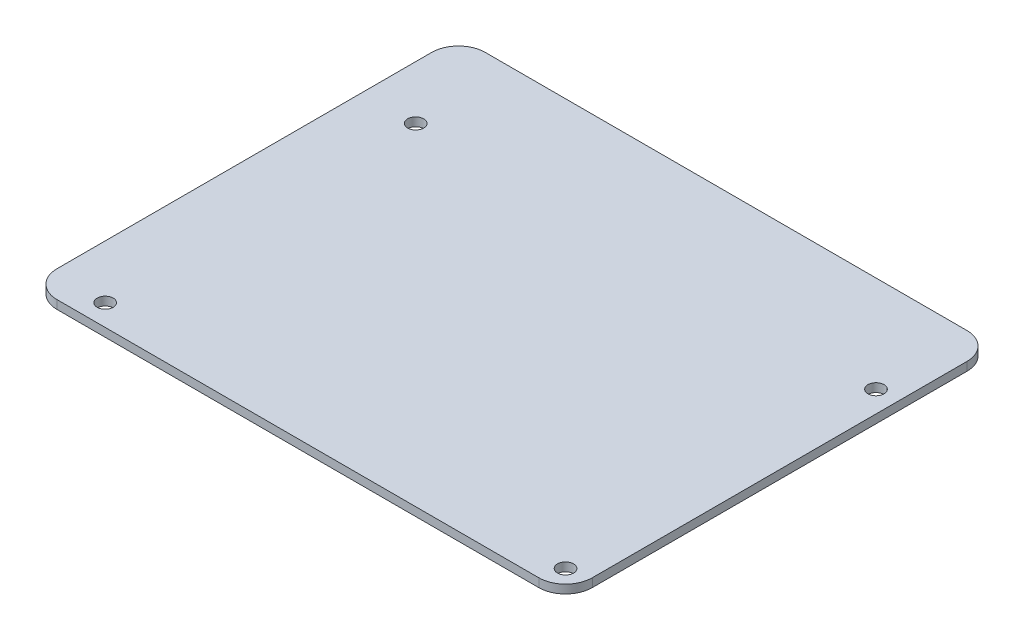
ISO-10303-21;
HEADER;
FILE_DESCRIPTION(('STEP AP214'),'2;1');
FILE_NAME('part.step','',(''),(''),'','','');
FILE_SCHEMA(('AUTOMOTIVE_DESIGN { 1 0 10303 214 1 1 1 1 }'));
ENDSEC;
DATA;
#1=APPLICATION_CONTEXT('core data for automotive mechanical design processes');
#2=APPLICATION_PROTOCOL_DEFINITION('international standard','automotive_design',2000,#1);
#3=PRODUCT_CONTEXT('',#1,'mechanical');
#4=PRODUCT('Part','Part','',(#3));
#5=PRODUCT_RELATED_PRODUCT_CATEGORY('part','',(#4));
#6=PRODUCT_DEFINITION_FORMATION('','',#4);
#7=PRODUCT_DEFINITION_CONTEXT('part definition',#1,'design');
#8=PRODUCT_DEFINITION('design','',#6,#7);
#9=PRODUCT_DEFINITION_SHAPE('','',#8);
#10=(LENGTH_UNIT() NAMED_UNIT(*) SI_UNIT(.MILLI.,.METRE.));
#11=(NAMED_UNIT(*) PLANE_ANGLE_UNIT() SI_UNIT($,.RADIAN.));
#12=(NAMED_UNIT(*) SI_UNIT($,.STERADIAN.) SOLID_ANGLE_UNIT());
#13=UNCERTAINTY_MEASURE_WITH_UNIT(LENGTH_MEASURE(1.E-05),#10,'distance_accuracy_value','');
#14=(GEOMETRIC_REPRESENTATION_CONTEXT(3) GLOBAL_UNCERTAINTY_ASSIGNED_CONTEXT((#13)) GLOBAL_UNIT_ASSIGNED_CONTEXT((#10,
#11,#12)) REPRESENTATION_CONTEXT('',''));
#15=CARTESIAN_POINT('',(0.,0.,0.));
#16=DIRECTION('',(0.,0.,1.));
#17=DIRECTION('',(1.,0.,0.));
#18=AXIS2_PLACEMENT_3D('',#15,#16,#17);
#19=CARTESIAN_POINT('',(50.,0.,40.));
#20=DIRECTION('',(0.,1.,0.));
#21=DIRECTION('',(1.,0.,0.));
#22=AXIS2_PLACEMENT_3D('',#19,#20,#21);
#23=PLANE('',#22);
#24=CARTESIAN_POINT('',(10.0000001490116,0.,76.0000011324883));
#25=DIRECTION('',(0.,1.,0.));
#26=DIRECTION('',(1.,0.,0.));
#27=AXIS2_PLACEMENT_3D('',#24,#25,#26);
#28=CIRCLE('',#27,1.5);
#29=CARTESIAN_POINT('',(8.50000014901161,0.,76.0000011324883));
#30=VERTEX_POINT('',#29);
#31=EDGE_CURVE('E218',#30,#30,#28,.T.);
#32=ORIENTED_EDGE('',*,*,#31,.T.);
#33=EDGE_LOOP('',(#32));
#34=FACE_BOUND('',#33,.T.);
#35=CARTESIAN_POINT('',(96.0000014305115,0.,76.0000011324883));
#36=DIRECTION('',(0.,1.,0.));
#37=DIRECTION('',(1.,0.,0.));
#38=AXIS2_PLACEMENT_3D('',#35,#36,#37);
#39=CIRCLE('',#38,1.5);
#40=CARTESIAN_POINT('',(94.5000014305115,0.,76.0000011324883));
#41=VERTEX_POINT('',#40);
#42=EDGE_CURVE('E210',#41,#41,#39,.T.);
#43=ORIENTED_EDGE('',*,*,#42,.T.);
#44=EDGE_LOOP('',(#43));
#45=FACE_BOUND('',#44,.T.);
#46=CARTESIAN_POINT('',(96.0000014305115,0.,18.0000002682209));
#47=DIRECTION('',(0.,1.,0.));
#48=DIRECTION('',(1.,0.,0.));
#49=AXIS2_PLACEMENT_3D('',#46,#47,#48);
#50=CIRCLE('',#49,1.5);
#51=CARTESIAN_POINT('',(94.5000014305115,0.,18.0000002682209));
#52=VERTEX_POINT('',#51);
#53=EDGE_CURVE('E257',#52,#52,#50,.T.);
#54=ORIENTED_EDGE('',*,*,#53,.T.);
#55=EDGE_LOOP('',(#54));
#56=FACE_BOUND('',#55,.T.);
#57=CARTESIAN_POINT('',(10.0000001490116,0.,18.0000002682209));
#58=DIRECTION('',(0.,1.,0.));
#59=DIRECTION('',(1.,0.,0.));
#60=AXIS2_PLACEMENT_3D('',#57,#58,#59);
#61=CIRCLE('',#60,1.5);
#62=CARTESIAN_POINT('',(8.50000014901161,0.,18.0000002682209));
#63=VERTEX_POINT('',#62);
#64=EDGE_CURVE('E206',#63,#63,#61,.T.);
#65=ORIENTED_EDGE('',*,*,#64,.T.);
#66=EDGE_LOOP('',(#65));
#67=FACE_BOUND('',#66,.T.);
#68=CARTESIAN_POINT('',(95.,0.,5.));
#69=DIRECTION('',(0.,1.,0.));
#70=DIRECTION('',(1.,0.,0.));
#71=AXIS2_PLACEMENT_3D('',#68,#69,#70);
#72=CIRCLE('',#71,5.);
#73=CARTESIAN_POINT('',(100.,0.,5.));
#74=VERTEX_POINT('',#73);
#75=CARTESIAN_POINT('',(95.,0.,0.));
#76=VERTEX_POINT('',#75);
#77=EDGE_CURVE('E26',#74,#76,#72,.T.);
#78=ORIENTED_EDGE('',*,*,#77,.F.);
#79=DIRECTION('',(0.,0.,1.));
#80=VECTOR('',#79,1.);
#81=CARTESIAN_POINT('',(100.,0.,5.));
#82=LINE('',#81,#80);
#83=CARTESIAN_POINT('',(100.,0.,75.));
#84=VERTEX_POINT('',#83);
#85=EDGE_CURVE('E203',#74,#84,#82,.T.);
#86=ORIENTED_EDGE('',*,*,#85,.T.);
#87=CARTESIAN_POINT('',(95.,0.,75.));
#88=DIRECTION('',(0.,1.,0.));
#89=DIRECTION('',(0.,0.,1.));
#90=AXIS2_PLACEMENT_3D('',#87,#88,#89);
#91=CIRCLE('',#90,5.);
#92=CARTESIAN_POINT('',(95.,0.,80.));
#93=VERTEX_POINT('',#92);
#94=EDGE_CURVE('E170',#93,#84,#91,.T.);
#95=ORIENTED_EDGE('',*,*,#94,.F.);
#96=DIRECTION('',(-1.,0.,0.));
#97=VECTOR('',#96,1.);
#98=CARTESIAN_POINT('',(95.,0.,80.));
#99=LINE('',#98,#97);
#100=CARTESIAN_POINT('',(5.,0.,80.));
#101=VERTEX_POINT('',#100);
#102=EDGE_CURVE('E155',#93,#101,#99,.T.);
#103=ORIENTED_EDGE('',*,*,#102,.T.);
#104=CARTESIAN_POINT('',(5.,0.,75.));
#105=DIRECTION('',(0.,1.,0.));
#106=DIRECTION('',(-1.,0.,0.));
#107=AXIS2_PLACEMENT_3D('',#104,#105,#106);
#108=CIRCLE('',#107,5.);
#109=CARTESIAN_POINT('',(0.,0.,75.));
#110=VERTEX_POINT('',#109);
#111=EDGE_CURVE('E19',#110,#101,#108,.T.);
#112=ORIENTED_EDGE('',*,*,#111,.F.);
#113=DIRECTION('',(0.,0.,-1.));
#114=VECTOR('',#113,1.);
#115=CARTESIAN_POINT('',(0.,0.,75.));
#116=LINE('',#115,#114);
#117=CARTESIAN_POINT('',(0.,0.,5.));
#118=VERTEX_POINT('',#117);
#119=EDGE_CURVE('E119',#110,#118,#116,.T.);
#120=ORIENTED_EDGE('',*,*,#119,.T.);
#121=CARTESIAN_POINT('',(5.,0.,5.));
#122=DIRECTION('',(0.,1.,0.));
#123=DIRECTION('',(0.,0.,-1.));
#124=AXIS2_PLACEMENT_3D('',#121,#122,#123);
#125=CIRCLE('',#124,5.);
#126=CARTESIAN_POINT('',(5.,0.,0.));
#127=VERTEX_POINT('',#126);
#128=EDGE_CURVE('E136',#127,#118,#125,.T.);
#129=ORIENTED_EDGE('',*,*,#128,.F.);
#130=DIRECTION('',(1.,0.,0.));
#131=VECTOR('',#130,1.);
#132=CARTESIAN_POINT('',(5.,0.,0.));
#133=LINE('',#132,#131);
#134=EDGE_CURVE('E190',#127,#76,#133,.T.);
#135=ORIENTED_EDGE('',*,*,#134,.T.);
#136=EDGE_LOOP('',(#78,#86,#95,#103,#112,#120,#129,#135));
#137=FACE_BOUND('',#136,.T.);
#138=ADVANCED_FACE('F15',(#34,#45,#56,#67,#137),#23,.F.);
#139=CARTESIAN_POINT('',(50.,1.6,40.));
#140=DIRECTION('',(0.,1.,0.));
#141=DIRECTION('',(1.,0.,0.));
#142=AXIS2_PLACEMENT_3D('',#139,#140,#141);
#143=PLANE('',#142);
#144=CARTESIAN_POINT('',(10.0000001490116,1.6,76.0000011324883));
#145=DIRECTION('',(0.,-1.,0.));
#146=DIRECTION('',(1.,0.,0.));
#147=AXIS2_PLACEMENT_3D('',#144,#145,#146);
#148=CIRCLE('',#147,1.5);
#149=CARTESIAN_POINT('',(8.50000014901161,1.6,76.0000011324883));
#150=VERTEX_POINT('',#149);
#151=EDGE_CURVE('E219',#150,#150,#148,.T.);
#152=ORIENTED_EDGE('',*,*,#151,.T.);
#153=EDGE_LOOP('',(#152));
#154=FACE_BOUND('',#153,.T.);
#155=CARTESIAN_POINT('',(96.0000014305115,1.6,76.0000011324883));
#156=DIRECTION('',(0.,-1.,0.));
#157=DIRECTION('',(1.,0.,0.));
#158=AXIS2_PLACEMENT_3D('',#155,#156,#157);
#159=CIRCLE('',#158,1.5);
#160=CARTESIAN_POINT('',(94.5000014305115,1.6,76.0000011324883));
#161=VERTEX_POINT('',#160);
#162=EDGE_CURVE('E222',#161,#161,#159,.T.);
#163=ORIENTED_EDGE('',*,*,#162,.T.);
#164=EDGE_LOOP('',(#163));
#165=FACE_BOUND('',#164,.T.);
#166=CARTESIAN_POINT('',(96.0000014305115,1.6,18.0000002682209));
#167=DIRECTION('',(0.,-1.,0.));
#168=DIRECTION('',(1.,0.,0.));
#169=AXIS2_PLACEMENT_3D('',#166,#167,#168);
#170=CIRCLE('',#169,1.5);
#171=CARTESIAN_POINT('',(94.5000014305115,1.6,18.0000002682209));
#172=VERTEX_POINT('',#171);
#173=EDGE_CURVE('E179',#172,#172,#170,.T.);
#174=ORIENTED_EDGE('',*,*,#173,.T.);
#175=EDGE_LOOP('',(#174));
#176=FACE_BOUND('',#175,.T.);
#177=CARTESIAN_POINT('',(10.0000001490116,1.6,18.0000002682209));
#178=DIRECTION('',(0.,-1.,0.));
#179=DIRECTION('',(1.,0.,0.));
#180=AXIS2_PLACEMENT_3D('',#177,#178,#179);
#181=CIRCLE('',#180,1.5);
#182=CARTESIAN_POINT('',(8.50000014901161,1.6,18.0000002682209));
#183=VERTEX_POINT('',#182);
#184=EDGE_CURVE('E236',#183,#183,#181,.T.);
#185=ORIENTED_EDGE('',*,*,#184,.T.);
#186=EDGE_LOOP('',(#185));
#187=FACE_BOUND('',#186,.T.);
#188=CARTESIAN_POINT('',(95.,1.6,5.));
#189=DIRECTION('',(0.,1.,0.));
#190=DIRECTION('',(1.,0.,0.));
#191=AXIS2_PLACEMENT_3D('',#188,#189,#190);
#192=CIRCLE('',#191,5.);
#193=CARTESIAN_POINT('',(100.,1.6,5.));
#194=VERTEX_POINT('',#193);
#195=CARTESIAN_POINT('',(95.,1.6,0.));
#196=VERTEX_POINT('',#195);
#197=EDGE_CURVE('E9',#194,#196,#192,.T.);
#198=ORIENTED_EDGE('',*,*,#197,.T.);
#199=DIRECTION('',(-1.,0.,0.));
#200=VECTOR('',#199,1.);
#201=CARTESIAN_POINT('',(5.,1.6,0.));
#202=LINE('',#201,#200);
#203=CARTESIAN_POINT('',(5.,1.6,0.));
#204=VERTEX_POINT('',#203);
#205=EDGE_CURVE('E230',#196,#204,#202,.T.);
#206=ORIENTED_EDGE('',*,*,#205,.T.);
#207=CARTESIAN_POINT('',(5.,1.6,5.));
#208=DIRECTION('',(0.,1.,0.));
#209=DIRECTION('',(0.,0.,-1.));
#210=AXIS2_PLACEMENT_3D('',#207,#208,#209);
#211=CIRCLE('',#210,5.);
#212=CARTESIAN_POINT('',(0.,1.6,5.));
#213=VERTEX_POINT('',#212);
#214=EDGE_CURVE('E182',#204,#213,#211,.T.);
#215=ORIENTED_EDGE('',*,*,#214,.T.);
#216=DIRECTION('',(0.,0.,1.));
#217=VECTOR('',#216,1.);
#218=CARTESIAN_POINT('',(0.,1.6,75.));
#219=LINE('',#218,#217);
#220=CARTESIAN_POINT('',(0.,1.6,75.));
#221=VERTEX_POINT('',#220);
#222=EDGE_CURVE('E125',#213,#221,#219,.T.);
#223=ORIENTED_EDGE('',*,*,#222,.T.);
#224=CARTESIAN_POINT('',(5.,1.6,75.));
#225=DIRECTION('',(0.,1.,0.));
#226=DIRECTION('',(-1.,0.,0.));
#227=AXIS2_PLACEMENT_3D('',#224,#225,#226);
#228=CIRCLE('',#227,5.);
#229=CARTESIAN_POINT('',(5.,1.6,80.));
#230=VERTEX_POINT('',#229);
#231=EDGE_CURVE('E149',#221,#230,#228,.T.);
#232=ORIENTED_EDGE('',*,*,#231,.T.);
#233=DIRECTION('',(1.,0.,0.));
#234=VECTOR('',#233,1.);
#235=CARTESIAN_POINT('',(95.,1.6,80.));
#236=LINE('',#235,#234);
#237=CARTESIAN_POINT('',(95.,1.6,80.));
#238=VERTEX_POINT('',#237);
#239=EDGE_CURVE('E142',#230,#238,#236,.T.);
#240=ORIENTED_EDGE('',*,*,#239,.T.);
#241=CARTESIAN_POINT('',(95.,1.6,75.));
#242=DIRECTION('',(0.,1.,0.));
#243=DIRECTION('',(0.,0.,1.));
#244=AXIS2_PLACEMENT_3D('',#241,#242,#243);
#245=CIRCLE('',#244,5.);
#246=CARTESIAN_POINT('',(100.,1.6,75.));
#247=VERTEX_POINT('',#246);
#248=EDGE_CURVE('E146',#238,#247,#245,.T.);
#249=ORIENTED_EDGE('',*,*,#248,.T.);
#250=DIRECTION('',(0.,0.,-1.));
#251=VECTOR('',#250,1.);
#252=CARTESIAN_POINT('',(100.,1.6,5.));
#253=LINE('',#252,#251);
#254=EDGE_CURVE('E224',#247,#194,#253,.T.);
#255=ORIENTED_EDGE('',*,*,#254,.T.);
#256=EDGE_LOOP('',(#198,#206,#215,#223,#232,#240,#249,#255));
#257=FACE_BOUND('',#256,.T.);
#258=ADVANCED_FACE('F144',(#154,#165,#176,#187,#257),#143,.T.);
#259=CARTESIAN_POINT('',(95.,0.,5.));
#260=DIRECTION('',(0.,1.,0.));
#261=DIRECTION('',(1.,0.,0.));
#262=AXIS2_PLACEMENT_3D('',#259,#260,#261);
#263=CYLINDRICAL_SURFACE('',#262,5.);
#264=ORIENTED_EDGE('',*,*,#77,.T.);
#265=DIRECTION('',(0.,1.,0.));
#266=VECTOR('',#265,1.);
#267=CARTESIAN_POINT('',(95.,0.,0.));
#268=LINE('',#267,#266);
#269=EDGE_CURVE('E227',#76,#196,#268,.T.);
#270=ORIENTED_EDGE('',*,*,#269,.T.);
#271=ORIENTED_EDGE('',*,*,#197,.F.);
#272=DIRECTION('',(0.,1.,0.));
#273=VECTOR('',#272,1.);
#274=CARTESIAN_POINT('',(100.,0.,5.));
#275=LINE('',#274,#273);
#276=EDGE_CURVE('E205',#74,#194,#275,.T.);
#277=ORIENTED_EDGE('',*,*,#276,.F.);
#278=EDGE_LOOP('',(#264,#270,#271,#277));
#279=FACE_BOUND('',#278,.T.);
#280=ADVANCED_FACE('F287',(#279),#263,.T.);
#281=CARTESIAN_POINT('',(95.,0.,0.));
#282=DIRECTION('',(0.,0.,-1.));
#283=DIRECTION('',(0.,-1.,0.));
#284=AXIS2_PLACEMENT_3D('',#281,#282,#283);
#285=PLANE('',#284);
#286=ORIENTED_EDGE('',*,*,#134,.F.);
#287=DIRECTION('',(0.,1.,0.));
#288=VECTOR('',#287,1.);
#289=CARTESIAN_POINT('',(5.,0.,0.));
#290=LINE('',#289,#288);
#291=EDGE_CURVE('E184',#127,#204,#290,.T.);
#292=ORIENTED_EDGE('',*,*,#291,.T.);
#293=ORIENTED_EDGE('',*,*,#205,.F.);
#294=ORIENTED_EDGE('',*,*,#269,.F.);
#295=EDGE_LOOP('',(#286,#292,#293,#294));
#296=FACE_BOUND('',#295,.T.);
#297=ADVANCED_FACE('F292',(#296),#285,.T.);
#298=CARTESIAN_POINT('',(5.,0.,5.));
#299=DIRECTION('',(0.,1.,0.));
#300=DIRECTION('',(0.,0.,-1.));
#301=AXIS2_PLACEMENT_3D('',#298,#299,#300);
#302=CYLINDRICAL_SURFACE('',#301,5.);
#303=ORIENTED_EDGE('',*,*,#128,.T.);
#304=DIRECTION('',(0.,1.,0.));
#305=VECTOR('',#304,1.);
#306=CARTESIAN_POINT('',(0.,0.,5.));
#307=LINE('',#306,#305);
#308=EDGE_CURVE('E193',#118,#213,#307,.T.);
#309=ORIENTED_EDGE('',*,*,#308,.T.);
#310=ORIENTED_EDGE('',*,*,#214,.F.);
#311=ORIENTED_EDGE('',*,*,#291,.F.);
#312=EDGE_LOOP('',(#303,#309,#310,#311));
#313=FACE_BOUND('',#312,.T.);
#314=ADVANCED_FACE('F298',(#313),#302,.T.);
#315=CARTESIAN_POINT('',(0.,0.,5.));
#316=DIRECTION('',(-1.,0.,0.));
#317=DIRECTION('',(0.,0.,1.));
#318=AXIS2_PLACEMENT_3D('',#315,#316,#317);
#319=PLANE('',#318);
#320=ORIENTED_EDGE('',*,*,#119,.F.);
#321=DIRECTION('',(0.,1.,0.));
#322=VECTOR('',#321,1.);
#323=CARTESIAN_POINT('',(0.,0.,75.));
#324=LINE('',#323,#322);
#325=EDGE_CURVE('E181',#110,#221,#324,.T.);
#326=ORIENTED_EDGE('',*,*,#325,.T.);
#327=ORIENTED_EDGE('',*,*,#222,.F.);
#328=ORIENTED_EDGE('',*,*,#308,.F.);
#329=EDGE_LOOP('',(#320,#326,#327,#328));
#330=FACE_BOUND('',#329,.T.);
#331=ADVANCED_FACE('F303',(#330),#319,.T.);
#332=CARTESIAN_POINT('',(5.,0.,75.));
#333=DIRECTION('',(0.,1.,0.));
#334=DIRECTION('',(-1.,0.,0.));
#335=AXIS2_PLACEMENT_3D('',#332,#333,#334);
#336=CYLINDRICAL_SURFACE('',#335,5.);
#337=ORIENTED_EDGE('',*,*,#111,.T.);
#338=DIRECTION('',(0.,1.,0.));
#339=VECTOR('',#338,1.);
#340=CARTESIAN_POINT('',(5.,0.,80.));
#341=LINE('',#340,#339);
#342=EDGE_CURVE('E154',#101,#230,#341,.T.);
#343=ORIENTED_EDGE('',*,*,#342,.T.);
#344=ORIENTED_EDGE('',*,*,#231,.F.);
#345=ORIENTED_EDGE('',*,*,#325,.F.);
#346=EDGE_LOOP('',(#337,#343,#344,#345));
#347=FACE_BOUND('',#346,.T.);
#348=ADVANCED_FACE('F339',(#347),#336,.T.);
#349=CARTESIAN_POINT('',(5.,0.,80.));
#350=DIRECTION('',(0.,0.,1.));
#351=DIRECTION('',(1.,0.,0.));
#352=AXIS2_PLACEMENT_3D('',#349,#350,#351);
#353=PLANE('',#352);
#354=ORIENTED_EDGE('',*,*,#102,.F.);
#355=DIRECTION('',(0.,1.,0.));
#356=VECTOR('',#355,1.);
#357=CARTESIAN_POINT('',(95.,0.,80.));
#358=LINE('',#357,#356);
#359=EDGE_CURVE('E158',#93,#238,#358,.T.);
#360=ORIENTED_EDGE('',*,*,#359,.T.);
#361=ORIENTED_EDGE('',*,*,#239,.F.);
#362=ORIENTED_EDGE('',*,*,#342,.F.);
#363=EDGE_LOOP('',(#354,#360,#361,#362));
#364=FACE_BOUND('',#363,.T.);
#365=ADVANCED_FACE('F159',(#364),#353,.T.);
#366=CARTESIAN_POINT('',(95.,0.,75.));
#367=DIRECTION('',(0.,1.,0.));
#368=DIRECTION('',(0.,0.,1.));
#369=AXIS2_PLACEMENT_3D('',#366,#367,#368);
#370=CYLINDRICAL_SURFACE('',#369,5.);
#371=ORIENTED_EDGE('',*,*,#94,.T.);
#372=DIRECTION('',(0.,1.,0.));
#373=VECTOR('',#372,1.);
#374=CARTESIAN_POINT('',(100.,0.,75.));
#375=LINE('',#374,#373);
#376=EDGE_CURVE('E167',#84,#247,#375,.T.);
#377=ORIENTED_EDGE('',*,*,#376,.T.);
#378=ORIENTED_EDGE('',*,*,#248,.F.);
#379=ORIENTED_EDGE('',*,*,#359,.F.);
#380=EDGE_LOOP('',(#371,#377,#378,#379));
#381=FACE_BOUND('',#380,.T.);
#382=ADVANCED_FACE('F165',(#381),#370,.T.);
#383=CARTESIAN_POINT('',(100.,0.,75.));
#384=DIRECTION('',(1.,0.,0.));
#385=DIRECTION('',(0.,1.,0.));
#386=AXIS2_PLACEMENT_3D('',#383,#384,#385);
#387=PLANE('',#386);
#388=ORIENTED_EDGE('',*,*,#85,.F.);
#389=ORIENTED_EDGE('',*,*,#276,.T.);
#390=ORIENTED_EDGE('',*,*,#254,.F.);
#391=ORIENTED_EDGE('',*,*,#376,.F.);
#392=EDGE_LOOP('',(#388,#389,#390,#391));
#393=FACE_BOUND('',#392,.T.);
#394=ADVANCED_FACE('F384',(#393),#387,.T.);
#395=CARTESIAN_POINT('',(10.0000001490116,0.,18.0000002682209));
#396=DIRECTION('',(0.,1.,0.));
#397=DIRECTION('',(1.,0.,0.));
#398=AXIS2_PLACEMENT_3D('',#395,#396,#397);
#399=CYLINDRICAL_SURFACE('',#398,1.5);
#400=ORIENTED_EDGE('',*,*,#184,.F.);
#401=DIRECTION('',(0.,-1.,0.));
#402=VECTOR('',#401,1.);
#403=CARTESIAN_POINT('',(8.50000014901161,0.,18.0000002682209));
#404=LINE('',#403,#402);
#405=EDGE_CURVE('E233',#183,#63,#404,.T.);
#406=ORIENTED_EDGE('',*,*,#405,.T.);
#407=ORIENTED_EDGE('',*,*,#64,.F.);
#408=ORIENTED_EDGE('',*,*,#405,.F.);
#409=EDGE_LOOP('',(#400,#406,#407,#408));
#410=FACE_BOUND('',#409,.T.);
#411=ADVANCED_FACE('F17',(#410),#399,.F.);
#412=CARTESIAN_POINT('',(96.0000014305115,0.,18.0000002682209));
#413=DIRECTION('',(0.,1.,0.));
#414=DIRECTION('',(1.,0.,0.));
#415=AXIS2_PLACEMENT_3D('',#412,#413,#414);
#416=CYLINDRICAL_SURFACE('',#415,1.5);
#417=ORIENTED_EDGE('',*,*,#173,.F.);
#418=DIRECTION('',(0.,-1.,0.));
#419=VECTOR('',#418,1.);
#420=CARTESIAN_POINT('',(94.5000014305115,0.,18.0000002682209));
#421=LINE('',#420,#419);
#422=EDGE_CURVE('E252',#172,#52,#421,.T.);
#423=ORIENTED_EDGE('',*,*,#422,.T.);
#424=ORIENTED_EDGE('',*,*,#53,.F.);
#425=ORIENTED_EDGE('',*,*,#422,.F.);
#426=EDGE_LOOP('',(#417,#423,#424,#425));
#427=FACE_BOUND('',#426,.T.);
#428=ADVANCED_FACE('F317',(#427),#416,.F.);
#429=CARTESIAN_POINT('',(96.0000014305115,0.,76.0000011324883));
#430=DIRECTION('',(0.,1.,0.));
#431=DIRECTION('',(1.,0.,0.));
#432=AXIS2_PLACEMENT_3D('',#429,#430,#431);
#433=CYLINDRICAL_SURFACE('',#432,1.5);
#434=ORIENTED_EDGE('',*,*,#162,.F.);
#435=DIRECTION('',(0.,-1.,0.));
#436=VECTOR('',#435,1.);
#437=CARTESIAN_POINT('',(94.5000014305115,0.,76.0000011324883));
#438=LINE('',#437,#436);
#439=EDGE_CURVE('E213',#161,#41,#438,.T.);
#440=ORIENTED_EDGE('',*,*,#439,.T.);
#441=ORIENTED_EDGE('',*,*,#42,.F.);
#442=ORIENTED_EDGE('',*,*,#439,.F.);
#443=EDGE_LOOP('',(#434,#440,#441,#442));
#444=FACE_BOUND('',#443,.T.);
#445=ADVANCED_FACE('F311',(#444),#433,.F.);
#446=CARTESIAN_POINT('',(10.0000001490116,0.,76.0000011324883));
#447=DIRECTION('',(0.,1.,0.));
#448=DIRECTION('',(1.,0.,0.));
#449=AXIS2_PLACEMENT_3D('',#446,#447,#448);
#450=CYLINDRICAL_SURFACE('',#449,1.5);
#451=ORIENTED_EDGE('',*,*,#151,.F.);
#452=DIRECTION('',(0.,-1.,0.));
#453=VECTOR('',#452,1.);
#454=CARTESIAN_POINT('',(8.50000014901161,0.,76.0000011324883));
#455=LINE('',#454,#453);
#456=EDGE_CURVE('E214',#150,#30,#455,.T.);
#457=ORIENTED_EDGE('',*,*,#456,.T.);
#458=ORIENTED_EDGE('',*,*,#31,.F.);
#459=ORIENTED_EDGE('',*,*,#456,.F.);
#460=EDGE_LOOP('',(#451,#457,#458,#459));
#461=FACE_BOUND('',#460,.T.);
#462=ADVANCED_FACE('F316',(#461),#450,.F.);
#463=CLOSED_SHELL('',(#138,#258,#280,#297,#314,#331,#348,#365,#382,#394,#411,#428,#445,#462));
#464=MANIFOLD_SOLID_BREP('B1',#463);
#465=ADVANCED_BREP_SHAPE_REPRESENTATION('',(#18,#464),#14);
#466=SHAPE_DEFINITION_REPRESENTATION(#9,#465);
ENDSEC;
END-ISO-10303-21;
